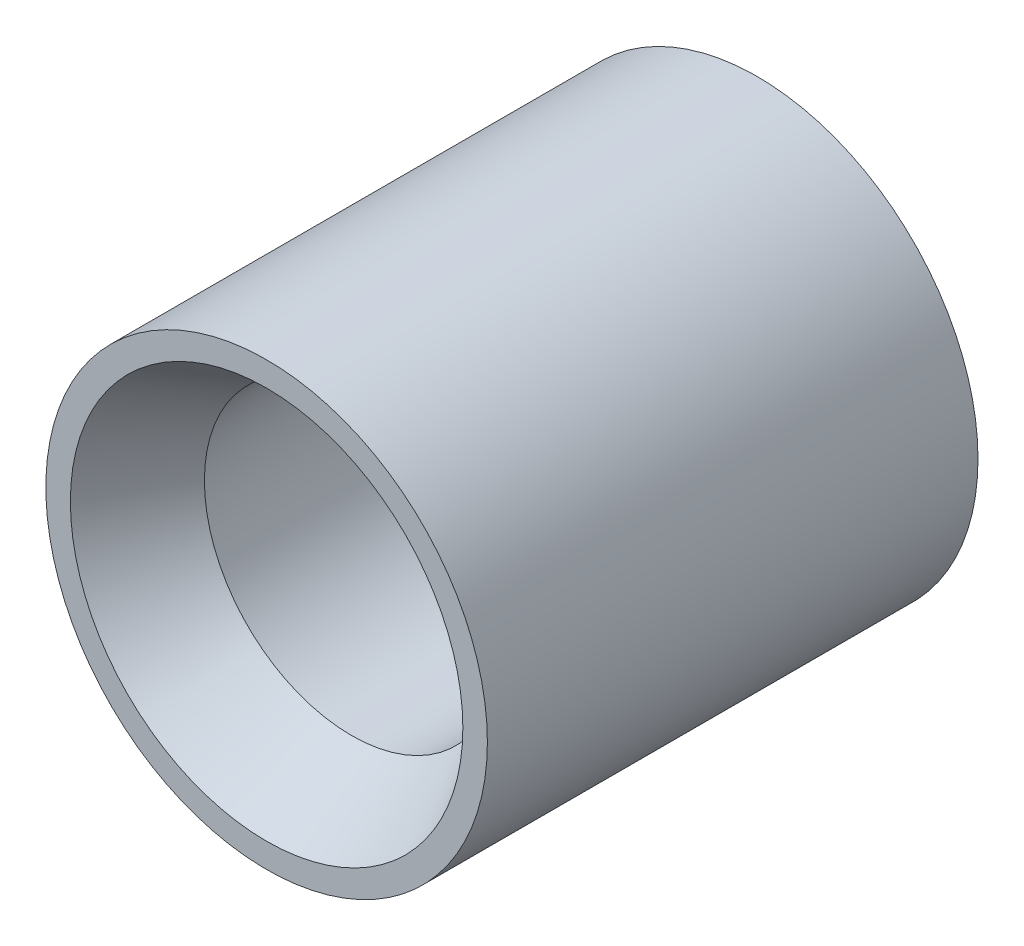
ISO-10303-21;
HEADER;
FILE_DESCRIPTION(('STEP AP214'),'2;1');
FILE_NAME('part.step','',(''),(''),'','','');
FILE_SCHEMA(('AUTOMOTIVE_DESIGN { 1 0 10303 214 1 1 1 1 }'));
ENDSEC;
DATA;
#1=APPLICATION_CONTEXT('core data for automotive mechanical design processes');
#2=APPLICATION_PROTOCOL_DEFINITION('international standard','automotive_design',2000,#1);
#3=PRODUCT_CONTEXT('',#1,'mechanical');
#4=PRODUCT('Part','Part','',(#3));
#5=PRODUCT_RELATED_PRODUCT_CATEGORY('part','',(#4));
#6=PRODUCT_DEFINITION_FORMATION('','',#4);
#7=PRODUCT_DEFINITION_CONTEXT('part definition',#1,'design');
#8=PRODUCT_DEFINITION('design','',#6,#7);
#9=PRODUCT_DEFINITION_SHAPE('','',#8);
#10=(LENGTH_UNIT() NAMED_UNIT(*) SI_UNIT(.MILLI.,.METRE.));
#11=(NAMED_UNIT(*) PLANE_ANGLE_UNIT() SI_UNIT($,.RADIAN.));
#12=(NAMED_UNIT(*) SI_UNIT($,.STERADIAN.) SOLID_ANGLE_UNIT());
#13=UNCERTAINTY_MEASURE_WITH_UNIT(LENGTH_MEASURE(1.E-05),#10,'distance_accuracy_value','');
#14=(GEOMETRIC_REPRESENTATION_CONTEXT(3) GLOBAL_UNCERTAINTY_ASSIGNED_CONTEXT((#13)) GLOBAL_UNIT_ASSIGNED_CONTEXT((#10,
#11,#12)) REPRESENTATION_CONTEXT('',''));
#15=CARTESIAN_POINT('',(0.,0.,0.));
#16=DIRECTION('',(0.,0.,1.));
#17=DIRECTION('',(1.,0.,0.));
#18=AXIS2_PLACEMENT_3D('',#15,#16,#17);
#19=CARTESIAN_POINT('',(0.,0.,10.));
#20=DIRECTION('',(0.,0.,1.));
#21=DIRECTION('',(1.,0.,0.));
#22=AXIS2_PLACEMENT_3D('',#19,#20,#21);
#23=PLANE('',#22);
#24=CARTESIAN_POINT('',(0.,0.,10.));
#25=DIRECTION('',(0.,0.,-1.));
#26=DIRECTION('',(-1.,0.,0.));
#27=AXIS2_PLACEMENT_3D('',#24,#25,#26);
#28=CIRCLE('',#27,4.);
#29=CARTESIAN_POINT('',(-4.,0.,10.));
#30=VERTEX_POINT('',#29);
#31=EDGE_CURVE('E57',#30,#30,#28,.T.);
#32=ORIENTED_EDGE('',*,*,#31,.T.);
#33=EDGE_LOOP('',(#32));
#34=FACE_BOUND('',#33,.T.);
#35=CARTESIAN_POINT('',(0.,0.,10.));
#36=DIRECTION('',(0.,0.,1.));
#37=DIRECTION('',(1.,0.,0.));
#38=AXIS2_PLACEMENT_3D('',#35,#36,#37);
#39=CIRCLE('',#38,4.5);
#40=CARTESIAN_POINT('',(4.5,0.,10.));
#41=VERTEX_POINT('',#40);
#42=EDGE_CURVE('E11',#41,#41,#39,.T.);
#43=ORIENTED_EDGE('',*,*,#42,.T.);
#44=EDGE_LOOP('',(#43));
#45=FACE_BOUND('',#44,.T.);
#46=ADVANCED_FACE('F40',(#34,#45),#23,.T.);
#47=CARTESIAN_POINT('',(0.,0.,0.));
#48=DIRECTION('',(0.,0.,1.));
#49=DIRECTION('',(1.,0.,0.));
#50=AXIS2_PLACEMENT_3D('',#47,#48,#49);
#51=PLANE('',#50);
#52=CARTESIAN_POINT('',(0.,0.,0.));
#53=DIRECTION('',(0.,0.,1.));
#54=DIRECTION('',(1.,0.,0.));
#55=AXIS2_PLACEMENT_3D('',#52,#53,#54);
#56=CIRCLE('',#55,4.5);
#57=CARTESIAN_POINT('',(4.5,0.,0.));
#58=VERTEX_POINT('',#57);
#59=EDGE_CURVE('E48',#58,#58,#56,.T.);
#60=ORIENTED_EDGE('',*,*,#59,.F.);
#61=EDGE_LOOP('',(#60));
#62=FACE_BOUND('',#61,.T.);
#63=CARTESIAN_POINT('',(0.,0.,0.));
#64=DIRECTION('',(0.,0.,1.));
#65=DIRECTION('',(1.,0.,0.));
#66=AXIS2_PLACEMENT_3D('',#63,#64,#65);
#67=CIRCLE('',#66,3.);
#68=CARTESIAN_POINT('',(3.,0.,0.));
#69=VERTEX_POINT('',#68);
#70=EDGE_CURVE('E53',#69,#69,#67,.T.);
#71=ORIENTED_EDGE('',*,*,#70,.T.);
#72=EDGE_LOOP('',(#71));
#73=FACE_BOUND('',#72,.T.);
#74=ADVANCED_FACE('F73',(#62,#73),#51,.F.);
#75=CARTESIAN_POINT('',(0.,0.,10.));
#76=DIRECTION('',(0.,0.,-1.));
#77=DIRECTION('',(-1.,0.,0.));
#78=AXIS2_PLACEMENT_3D('',#75,#76,#77);
#79=CYLINDRICAL_SURFACE('',#78,4.5);
#80=ORIENTED_EDGE('',*,*,#42,.F.);
#81=EDGE_LOOP('',(#80));
#82=FACE_BOUND('',#81,.T.);
#83=ORIENTED_EDGE('',*,*,#59,.T.);
#84=EDGE_LOOP('',(#83));
#85=FACE_BOUND('',#84,.T.);
#86=ADVANCED_FACE('F42',(#82,#85),#79,.T.);
#87=CARTESIAN_POINT('',(0.,0.,10.));
#88=DIRECTION('',(0.,0.,-1.));
#89=DIRECTION('',(-1.,0.,0.));
#90=AXIS2_PLACEMENT_3D('',#87,#88,#89);
#91=CYLINDRICAL_SURFACE('',#90,3.);
#92=CARTESIAN_POINT('',(0.,0.,8.2679491924311));
#93=DIRECTION('',(0.,0.,1.));
#94=DIRECTION('',(1.,0.,0.));
#95=AXIS2_PLACEMENT_3D('',#92,#93,#94);
#96=CIRCLE('',#95,3.);
#97=CARTESIAN_POINT('',(3.,0.,8.2679491924311));
#98=VERTEX_POINT('',#97);
#99=EDGE_CURVE('E44',#98,#98,#96,.F.);
#100=ORIENTED_EDGE('',*,*,#99,.F.);
#101=EDGE_LOOP('',(#100));
#102=FACE_BOUND('',#101,.T.);
#103=ORIENTED_EDGE('',*,*,#70,.F.);
#104=EDGE_LOOP('',(#103));
#105=FACE_BOUND('',#104,.T.);
#106=ADVANCED_FACE('F67',(#102,#105),#91,.F.);
#107=CARTESIAN_POINT('',(0.,0.,3.07179676972439));
#108=DIRECTION('',(0.,0.,1.));
#109=DIRECTION('',(1.,0.,0.));
#110=AXIS2_PLACEMENT_3D('',#107,#108,#109);
#111=CONICAL_SURFACE('',#110,0.,0.523598775598293);
#112=ORIENTED_EDGE('',*,*,#99,.T.);
#113=EDGE_LOOP('',(#112));
#114=FACE_BOUND('',#113,.T.);
#115=ORIENTED_EDGE('',*,*,#31,.F.);
#116=EDGE_LOOP('',(#115));
#117=FACE_BOUND('',#116,.T.);
#118=ADVANCED_FACE('F64',(#114,#117),#111,.F.);
#119=CLOSED_SHELL('',(#46,#74,#86,#106,#118));
#120=MANIFOLD_SOLID_BREP('B2',#119);
#121=ADVANCED_BREP_SHAPE_REPRESENTATION('',(#18,#120),#14);
#122=SHAPE_DEFINITION_REPRESENTATION(#9,#121);
ENDSEC;
END-ISO-10303-21;
